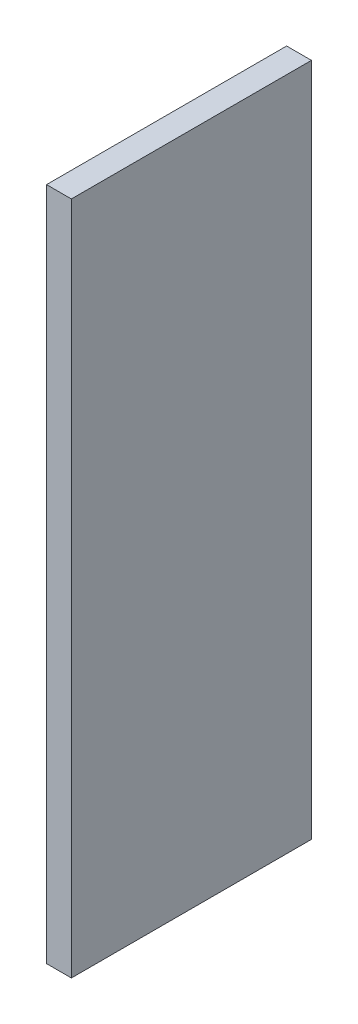
ISO-10303-21;
HEADER;
FILE_DESCRIPTION(('STEP AP214'),'2;1');
FILE_NAME('part.step','',(''),(''),'','','');
FILE_SCHEMA(('AUTOMOTIVE_DESIGN { 1 0 10303 214 1 1 1 1 }'));
ENDSEC;
DATA;
#1=APPLICATION_CONTEXT('core data for automotive mechanical design processes');
#2=APPLICATION_PROTOCOL_DEFINITION('international standard','automotive_design',2000,#1);
#3=PRODUCT_CONTEXT('',#1,'mechanical');
#4=PRODUCT('Part','Part','',(#3));
#5=PRODUCT_RELATED_PRODUCT_CATEGORY('part','',(#4));
#6=PRODUCT_DEFINITION_FORMATION('','',#4);
#7=PRODUCT_DEFINITION_CONTEXT('part definition',#1,'design');
#8=PRODUCT_DEFINITION('design','',#6,#7);
#9=PRODUCT_DEFINITION_SHAPE('','',#8);
#10=(LENGTH_UNIT() NAMED_UNIT(*) SI_UNIT(.MILLI.,.METRE.));
#11=(NAMED_UNIT(*) PLANE_ANGLE_UNIT() SI_UNIT($,.RADIAN.));
#12=(NAMED_UNIT(*) SI_UNIT($,.STERADIAN.) SOLID_ANGLE_UNIT());
#13=UNCERTAINTY_MEASURE_WITH_UNIT(LENGTH_MEASURE(1.E-05),#10,'distance_accuracy_value','');
#14=(GEOMETRIC_REPRESENTATION_CONTEXT(3) GLOBAL_UNCERTAINTY_ASSIGNED_CONTEXT((#13)) GLOBAL_UNIT_ASSIGNED_CONTEXT((#10,
#11,#12)) REPRESENTATION_CONTEXT('',''));
#15=CARTESIAN_POINT('',(0.,0.,0.));
#16=DIRECTION('',(0.,0.,1.));
#17=DIRECTION('',(1.,0.,0.));
#18=AXIS2_PLACEMENT_3D('',#15,#16,#17);
#19=CARTESIAN_POINT('',(6.35,0.,0.));
#20=DIRECTION('',(0.,0.,-1.));
#21=DIRECTION('',(-1.,0.,0.));
#22=AXIS2_PLACEMENT_3D('',#19,#20,#21);
#23=PLANE('',#22);
#24=DIRECTION('',(0.,-1.,0.));
#25=VECTOR('',#24,1.);
#26=CARTESIAN_POINT('',(0.,0.,0.));
#27=LINE('',#26,#25);
#28=CARTESIAN_POINT('',(0.,172.50918,0.));
#29=VERTEX_POINT('',#28);
#30=CARTESIAN_POINT('',(0.,0.,0.));
#31=VERTEX_POINT('',#30);
#32=EDGE_CURVE('E96',#29,#31,#27,.T.);
#33=ORIENTED_EDGE('',*,*,#32,.T.);
#34=DIRECTION('',(-1.,0.,0.));
#35=VECTOR('',#34,1.);
#36=CARTESIAN_POINT('',(6.35,0.,0.));
#37=LINE('',#36,#35);
#38=CARTESIAN_POINT('',(6.35,0.,0.));
#39=VERTEX_POINT('',#38);
#40=EDGE_CURVE('E11',#39,#31,#37,.T.);
#41=ORIENTED_EDGE('',*,*,#40,.F.);
#42=DIRECTION('',(0.,-1.,0.));
#43=VECTOR('',#42,1.);
#44=CARTESIAN_POINT('',(6.35,0.,0.));
#45=LINE('',#44,#43);
#46=CARTESIAN_POINT('',(6.35,172.50918,0.));
#47=VERTEX_POINT('',#46);
#48=EDGE_CURVE('E84',#47,#39,#45,.T.);
#49=ORIENTED_EDGE('',*,*,#48,.F.);
#50=DIRECTION('',(-1.,0.,0.));
#51=VECTOR('',#50,1.);
#52=CARTESIAN_POINT('',(6.35,172.50918,0.));
#53=LINE('',#52,#51);
#54=EDGE_CURVE('E92',#47,#29,#53,.T.);
#55=ORIENTED_EDGE('',*,*,#54,.T.);
#56=EDGE_LOOP('',(#33,#41,#49,#55));
#57=FACE_BOUND('',#56,.T.);
#58=ADVANCED_FACE('F33',(#57),#23,.F.);
#59=CARTESIAN_POINT('',(6.35,0.,0.));
#60=DIRECTION('',(0.,1.,0.));
#61=DIRECTION('',(0.,0.,1.));
#62=AXIS2_PLACEMENT_3D('',#59,#60,#61);
#63=PLANE('',#62);
#64=DIRECTION('',(0.,0.,-1.));
#65=VECTOR('',#64,1.);
#66=CARTESIAN_POINT('',(0.,0.,0.));
#67=LINE('',#66,#65);
#68=CARTESIAN_POINT('',(0.,0.,-61.38418));
#69=VERTEX_POINT('',#68);
#70=EDGE_CURVE('E88',#31,#69,#67,.T.);
#71=ORIENTED_EDGE('',*,*,#70,.T.);
#72=DIRECTION('',(-1.,0.,0.));
#73=VECTOR('',#72,1.);
#74=CARTESIAN_POINT('',(6.35,0.,-61.38418));
#75=LINE('',#74,#73);
#76=CARTESIAN_POINT('',(6.35,0.,-61.38418));
#77=VERTEX_POINT('',#76);
#78=EDGE_CURVE('E41',#77,#69,#75,.T.);
#79=ORIENTED_EDGE('',*,*,#78,.F.);
#80=DIRECTION('',(0.,0.,-1.));
#81=VECTOR('',#80,1.);
#82=CARTESIAN_POINT('',(6.35,0.,0.));
#83=LINE('',#82,#81);
#84=EDGE_CURVE('E79',#39,#77,#83,.T.);
#85=ORIENTED_EDGE('',*,*,#84,.F.);
#86=ORIENTED_EDGE('',*,*,#40,.T.);
#87=EDGE_LOOP('',(#71,#79,#85,#86));
#88=FACE_BOUND('',#87,.T.);
#89=ADVANCED_FACE('F87',(#88),#63,.F.);
#90=CARTESIAN_POINT('',(6.35,0.,-61.38418));
#91=DIRECTION('',(0.,0.,1.));
#92=DIRECTION('',(1.,0.,0.));
#93=AXIS2_PLACEMENT_3D('',#90,#91,#92);
#94=PLANE('',#93);
#95=DIRECTION('',(0.,1.,0.));
#96=VECTOR('',#95,1.);
#97=CARTESIAN_POINT('',(0.,0.,-61.38418));
#98=LINE('',#97,#96);
#99=CARTESIAN_POINT('',(0.,172.50918,-61.38418));
#100=VERTEX_POINT('',#99);
#101=EDGE_CURVE('E66',#69,#100,#98,.T.);
#102=ORIENTED_EDGE('',*,*,#101,.T.);
#103=DIRECTION('',(-1.,0.,0.));
#104=VECTOR('',#103,1.);
#105=CARTESIAN_POINT('',(6.35,172.50918,-61.38418));
#106=LINE('',#105,#104);
#107=CARTESIAN_POINT('',(6.35,172.50918,-61.38418));
#108=VERTEX_POINT('',#107);
#109=EDGE_CURVE('E89',#108,#100,#106,.T.);
#110=ORIENTED_EDGE('',*,*,#109,.F.);
#111=DIRECTION('',(0.,1.,0.));
#112=VECTOR('',#111,1.);
#113=CARTESIAN_POINT('',(6.35,0.,-61.38418));
#114=LINE('',#113,#112);
#115=EDGE_CURVE('E82',#77,#108,#114,.T.);
#116=ORIENTED_EDGE('',*,*,#115,.F.);
#117=ORIENTED_EDGE('',*,*,#78,.T.);
#118=EDGE_LOOP('',(#102,#110,#116,#117));
#119=FACE_BOUND('',#118,.T.);
#120=ADVANCED_FACE('F90',(#119),#94,.F.);
#121=CARTESIAN_POINT('',(6.35,172.50918,0.));
#122=DIRECTION('',(0.,-1.,0.));
#123=DIRECTION('',(0.,0.,-1.));
#124=AXIS2_PLACEMENT_3D('',#121,#122,#123);
#125=PLANE('',#124);
#126=DIRECTION('',(0.,0.,1.));
#127=VECTOR('',#126,1.);
#128=CARTESIAN_POINT('',(0.,172.50918,0.));
#129=LINE('',#128,#127);
#130=EDGE_CURVE('E72',#100,#29,#129,.T.);
#131=ORIENTED_EDGE('',*,*,#130,.T.);
#132=ORIENTED_EDGE('',*,*,#54,.F.);
#133=DIRECTION('',(0.,0.,1.));
#134=VECTOR('',#133,1.);
#135=CARTESIAN_POINT('',(6.35,172.50918,0.));
#136=LINE('',#135,#134);
#137=EDGE_CURVE('E49',#108,#47,#136,.T.);
#138=ORIENTED_EDGE('',*,*,#137,.F.);
#139=ORIENTED_EDGE('',*,*,#109,.T.);
#140=EDGE_LOOP('',(#131,#132,#138,#139));
#141=FACE_BOUND('',#140,.T.);
#142=ADVANCED_FACE('F103',(#141),#125,.F.);
#143=CARTESIAN_POINT('',(6.35,0.,0.));
#144=DIRECTION('',(-1.,0.,0.));
#145=DIRECTION('',(0.,0.,1.));
#146=AXIS2_PLACEMENT_3D('',#143,#144,#145);
#147=PLANE('',#146);
#148=ORIENTED_EDGE('',*,*,#48,.T.);
#149=ORIENTED_EDGE('',*,*,#84,.T.);
#150=ORIENTED_EDGE('',*,*,#115,.T.);
#151=ORIENTED_EDGE('',*,*,#137,.T.);
#152=EDGE_LOOP('',(#148,#149,#150,#151));
#153=FACE_BOUND('',#152,.T.);
#154=ADVANCED_FACE('F80',(#153),#147,.F.);
#155=CARTESIAN_POINT('',(0.,0.,0.));
#156=DIRECTION('',(-1.,0.,0.));
#157=DIRECTION('',(0.,0.,1.));
#158=AXIS2_PLACEMENT_3D('',#155,#156,#157);
#159=PLANE('',#158);
#160=ORIENTED_EDGE('',*,*,#32,.F.);
#161=ORIENTED_EDGE('',*,*,#130,.F.);
#162=ORIENTED_EDGE('',*,*,#101,.F.);
#163=ORIENTED_EDGE('',*,*,#70,.F.);
#164=EDGE_LOOP('',(#160,#161,#162,#163));
#165=FACE_BOUND('',#164,.T.);
#166=ADVANCED_FACE('F106',(#165),#159,.T.);
#167=CLOSED_SHELL('',(#58,#89,#120,#142,#154,#166));
#168=MANIFOLD_SOLID_BREP('B2',#167);
#169=ADVANCED_BREP_SHAPE_REPRESENTATION('',(#18,#168),#14);
#170=SHAPE_DEFINITION_REPRESENTATION(#9,#169);
ENDSEC;
END-ISO-10303-21;
